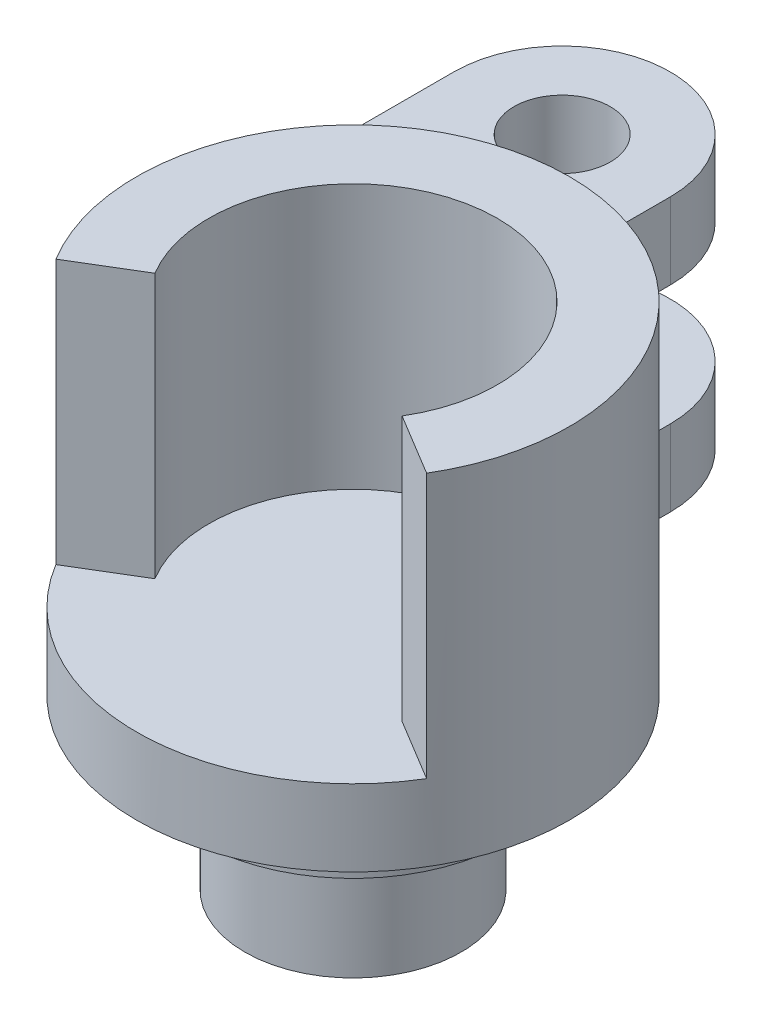
ISO-10303-21;
HEADER;
FILE_DESCRIPTION(('STEP AP214'),'2;1');
FILE_NAME('part.step','',(''),(''),'','','');
FILE_SCHEMA(('AUTOMOTIVE_DESIGN { 1 0 10303 214 1 1 1 1 }'));
ENDSEC;
DATA;
#1=APPLICATION_CONTEXT('core data for automotive mechanical design processes');
#2=APPLICATION_PROTOCOL_DEFINITION('international standard','automotive_design',2000,#1);
#3=PRODUCT_CONTEXT('',#1,'mechanical');
#4=PRODUCT('Part','Part','',(#3));
#5=PRODUCT_RELATED_PRODUCT_CATEGORY('part','',(#4));
#6=PRODUCT_DEFINITION_FORMATION('','',#4);
#7=PRODUCT_DEFINITION_CONTEXT('part definition',#1,'design');
#8=PRODUCT_DEFINITION('design','',#6,#7);
#9=PRODUCT_DEFINITION_SHAPE('','',#8);
#10=(LENGTH_UNIT() NAMED_UNIT(*) SI_UNIT(.MILLI.,.METRE.));
#11=(NAMED_UNIT(*) PLANE_ANGLE_UNIT() SI_UNIT($,.RADIAN.));
#12=(NAMED_UNIT(*) SI_UNIT($,.STERADIAN.) SOLID_ANGLE_UNIT());
#13=UNCERTAINTY_MEASURE_WITH_UNIT(LENGTH_MEASURE(1.E-05),#10,'distance_accuracy_value','');
#14=(GEOMETRIC_REPRESENTATION_CONTEXT(3) GLOBAL_UNCERTAINTY_ASSIGNED_CONTEXT((#13)) GLOBAL_UNIT_ASSIGNED_CONTEXT((#10,
#11,#12)) REPRESENTATION_CONTEXT('',''));
#15=CARTESIAN_POINT('',(0.,0.,0.));
#16=DIRECTION('',(0.,0.,1.));
#17=DIRECTION('',(1.,0.,0.));
#18=AXIS2_PLACEMENT_3D('',#15,#16,#17);
#19=CARTESIAN_POINT('',(0.,3.175,0.));
#20=DIRECTION('',(0.,-1.,0.));
#21=DIRECTION('',(0.,0.,-1.));
#22=AXIS2_PLACEMENT_3D('',#19,#20,#21);
#23=CYLINDRICAL_SURFACE('',#22,9.);
#24=DIRECTION('',(0.,-1.,0.));
#25=VECTOR('',#24,1.);
#26=CARTESIAN_POINT('',(0.,11.349999906,-9.));
#27=LINE('',#26,#25);
#28=CARTESIAN_POINT('',(0.,11.349999906,-9.));
#29=VERTEX_POINT('',#28);
#30=CARTESIAN_POINT('',(0.,8.174999906,-9.));
#31=VERTEX_POINT('',#30);
#32=EDGE_CURVE('E53',#29,#31,#27,.T.);
#33=ORIENTED_EDGE('',*,*,#32,.F.);
#34=CARTESIAN_POINT('',(0.,11.349999906,0.));
#35=DIRECTION('',(0.,-1.,0.));
#36=DIRECTION('',(0.,0.,1.));
#37=AXIS2_PLACEMENT_3D('',#34,#35,#36);
#38=CIRCLE('',#37,9.);
#39=CARTESIAN_POINT('',(-9.,11.349999906,0.));
#40=VERTEX_POINT('',#39);
#41=EDGE_CURVE('E58',#40,#29,#38,.T.);
#42=ORIENTED_EDGE('',*,*,#41,.F.);
#43=DIRECTION('',(0.,-1.,0.));
#44=VECTOR('',#43,1.);
#45=CARTESIAN_POINT('',(-9.,11.349999906,0.));
#46=LINE('',#45,#44);
#47=CARTESIAN_POINT('',(-9.,8.174999906,0.));
#48=VERTEX_POINT('',#47);
#49=EDGE_CURVE('E146',#40,#48,#46,.T.);
#50=ORIENTED_EDGE('',*,*,#49,.T.);
#51=CARTESIAN_POINT('',(0.,8.174999906,0.));
#52=DIRECTION('',(0.,-1.,0.));
#53=DIRECTION('',(0.,0.,1.));
#54=AXIS2_PLACEMENT_3D('',#51,#52,#53);
#55=CIRCLE('',#54,9.);
#56=EDGE_CURVE('E150',#48,#31,#55,.T.);
#57=ORIENTED_EDGE('',*,*,#56,.T.);
#58=EDGE_LOOP('',(#33,#42,#50,#57));
#59=FACE_BOUND('',#58,.T.);
#60=CARTESIAN_POINT('',(0.,3.175,0.));
#61=DIRECTION('',(0.,1.,0.));
#62=DIRECTION('',(0.,0.,1.));
#63=AXIS2_PLACEMENT_3D('',#60,#61,#62);
#64=CIRCLE('',#63,9.);
#65=CARTESIAN_POINT('',(-7.70770438364841,3.175,4.64664321142554));
#66=VERTEX_POINT('',#65);
#67=CARTESIAN_POINT('',(7.70770438364841,3.175,4.64664321142554));
#68=VERTEX_POINT('',#67);
#69=EDGE_CURVE('E202',#66,#68,#64,.T.);
#70=ORIENTED_EDGE('',*,*,#69,.F.);
#71=DIRECTION('',(0.,-1.,0.));
#72=VECTOR('',#71,1.);
#73=CARTESIAN_POINT('',(-7.70770438364841,14.175,4.64664321142554));
#74=LINE('',#73,#72);
#75=CARTESIAN_POINT('',(-7.70770438364841,14.175,4.64664321142554));
#76=VERTEX_POINT('',#75);
#77=EDGE_CURVE('E229',#76,#66,#74,.T.);
#78=ORIENTED_EDGE('',*,*,#77,.F.);
#79=CARTESIAN_POINT('',(0.,14.175,0.));
#80=DIRECTION('',(0.,1.,0.));
#81=DIRECTION('',(0.,0.,-1.));
#82=AXIS2_PLACEMENT_3D('',#79,#80,#81);
#83=CIRCLE('',#82,9.);
#84=CARTESIAN_POINT('',(7.70770438364841,14.175,4.64664321142554));
#85=VERTEX_POINT('',#84);
#86=EDGE_CURVE('E203',#85,#76,#83,.T.);
#87=ORIENTED_EDGE('',*,*,#86,.F.);
#88=DIRECTION('',(0.,-1.,0.));
#89=VECTOR('',#88,1.);
#90=CARTESIAN_POINT('',(7.70770438364841,14.175,4.64664321142554));
#91=LINE('',#90,#89);
#92=EDGE_CURVE('E213',#85,#68,#91,.T.);
#93=ORIENTED_EDGE('',*,*,#92,.T.);
#94=EDGE_LOOP('',(#70,#78,#87,#93));
#95=FACE_BOUND('',#94,.T.);
#96=DIRECTION('',(0.,-1.,0.));
#97=VECTOR('',#96,1.);
#98=CARTESIAN_POINT('',(0.,23.0265647372949,-9.));
#99=LINE('',#98,#97);
#100=CARTESIAN_POINT('',(0.,3.175,-9.));
#101=VERTEX_POINT('',#100);
#102=CARTESIAN_POINT('',(0.,0.,-9.));
#103=VERTEX_POINT('',#102);
#104=EDGE_CURVE('E175',#101,#103,#99,.T.);
#105=ORIENTED_EDGE('',*,*,#104,.F.);
#106=CARTESIAN_POINT('',(0.,3.175,0.));
#107=DIRECTION('',(0.,1.,0.));
#108=DIRECTION('',(0.,0.,1.));
#109=AXIS2_PLACEMENT_3D('',#106,#107,#108);
#110=CIRCLE('',#109,9.);
#111=CARTESIAN_POINT('',(-9.,3.175,0.));
#112=VERTEX_POINT('',#111);
#113=EDGE_CURVE('E183',#112,#101,#110,.F.);
#114=ORIENTED_EDGE('',*,*,#113,.F.);
#115=DIRECTION('',(0.,-1.,0.));
#116=VECTOR('',#115,1.);
#117=CARTESIAN_POINT('',(-9.,23.0265647372949,0.));
#118=LINE('',#117,#116);
#119=CARTESIAN_POINT('',(-9.,0.,0.));
#120=VERTEX_POINT('',#119);
#121=EDGE_CURVE('E162',#112,#120,#118,.T.);
#122=ORIENTED_EDGE('',*,*,#121,.T.);
#123=CARTESIAN_POINT('',(0.,0.,0.));
#124=DIRECTION('',(0.,1.,0.));
#125=DIRECTION('',(0.,0.,1.));
#126=AXIS2_PLACEMENT_3D('',#123,#124,#125);
#127=CIRCLE('',#126,9.);
#128=EDGE_CURVE('E232',#120,#103,#127,.T.);
#129=ORIENTED_EDGE('',*,*,#128,.T.);
#130=EDGE_LOOP('',(#105,#114,#122,#129));
#131=FACE_BOUND('',#130,.T.);
#132=ADVANCED_FACE('F37',(#59,#95,#131),#23,.T.);
#133=CARTESIAN_POINT('',(0.,3.175,0.));
#134=DIRECTION('',(0.,1.,0.));
#135=DIRECTION('',(0.,0.,1.));
#136=AXIS2_PLACEMENT_3D('',#133,#134,#135);
#137=PLANE('',#136);
#138=DIRECTION('',(0.856411598183157,0.,0.516293690158394));
#139=VECTOR('',#138,1.);
#140=CARTESIAN_POINT('',(5.13846958909894,3.175,3.09776214095036));
#141=LINE('',#140,#139);
#142=CARTESIAN_POINT('',(5.13846958909894,3.175,3.09776214095036));
#143=VERTEX_POINT('',#142);
#144=EDGE_CURVE('E207',#143,#68,#141,.T.);
#145=ORIENTED_EDGE('',*,*,#144,.F.);
#146=CARTESIAN_POINT('',(0.,3.175,0.));
#147=DIRECTION('',(0.,-1.,0.));
#148=DIRECTION('',(0.,0.,-1.));
#149=AXIS2_PLACEMENT_3D('',#146,#147,#148);
#150=CIRCLE('',#149,6.);
#151=CARTESIAN_POINT('',(-5.13846958909894,3.175,3.09776214095036));
#152=VERTEX_POINT('',#151);
#153=EDGE_CURVE('E216',#152,#143,#150,.T.);
#154=ORIENTED_EDGE('',*,*,#153,.F.);
#155=DIRECTION('',(0.856411598183157,0.,-0.516293690158393));
#156=VECTOR('',#155,1.);
#157=CARTESIAN_POINT('',(-7.70770438364841,3.175,4.64664321142554));
#158=LINE('',#157,#156);
#159=EDGE_CURVE('E199',#66,#152,#158,.T.);
#160=ORIENTED_EDGE('',*,*,#159,.F.);
#161=ORIENTED_EDGE('',*,*,#69,.T.);
#162=EDGE_LOOP('',(#145,#154,#160,#161));
#163=FACE_BOUND('',#162,.T.);
#164=ADVANCED_FACE('F263',(#163),#137,.T.);
#165=CARTESIAN_POINT('',(0.,0.,0.));
#166=DIRECTION('',(0.,1.,0.));
#167=DIRECTION('',(0.,0.,1.));
#168=AXIS2_PLACEMENT_3D('',#165,#166,#167);
#169=PLANE('',#168);
#170=CARTESIAN_POINT('',(-4.5,0.,-13.1941974251168));
#171=DIRECTION('',(0.,1.,0.));
#172=DIRECTION('',(0.,0.,1.));
#173=AXIS2_PLACEMENT_3D('',#170,#171,#172);
#174=CIRCLE('',#173,2.);
#175=CARTESIAN_POINT('',(-4.5,0.,-11.1941974251168));
#176=VERTEX_POINT('',#175);
#177=EDGE_CURVE('E304',#176,#176,#174,.F.);
#178=ORIENTED_EDGE('',*,*,#177,.F.);
#179=EDGE_LOOP('',(#178));
#180=FACE_BOUND('',#179,.T.);
#181=CARTESIAN_POINT('',(0.,0.,0.));
#182=DIRECTION('',(0.,-1.,0.));
#183=DIRECTION('',(0.,0.,-1.));
#184=AXIS2_PLACEMENT_3D('',#181,#182,#183);
#185=CIRCLE('',#184,6.5);
#186=CARTESIAN_POINT('',(0.,0.,-6.5));
#187=VERTEX_POINT('',#186);
#188=EDGE_CURVE('E45',#187,#187,#185,.T.);
#189=ORIENTED_EDGE('',*,*,#188,.F.);
#190=EDGE_LOOP('',(#189));
#191=FACE_BOUND('',#190,.T.);
#192=ORIENTED_EDGE('',*,*,#128,.F.);
#193=DIRECTION('',(0.,0.,1.));
#194=VECTOR('',#193,1.);
#195=CARTESIAN_POINT('',(-9.,0.,0.));
#196=LINE('',#195,#194);
#197=CARTESIAN_POINT('',(-9.,0.,-13.1941974251168));
#198=VERTEX_POINT('',#197);
#199=EDGE_CURVE('E163',#198,#120,#196,.T.);
#200=ORIENTED_EDGE('',*,*,#199,.F.);
#201=CARTESIAN_POINT('',(-4.5,0.,-13.1941974251168));
#202=DIRECTION('',(0.,1.,0.));
#203=DIRECTION('',(0.,0.,1.));
#204=AXIS2_PLACEMENT_3D('',#201,#202,#203);
#205=CIRCLE('',#204,4.5);
#206=CARTESIAN_POINT('',(0.,0.,-13.1941974251168));
#207=VERTEX_POINT('',#206);
#208=EDGE_CURVE('E168',#207,#198,#205,.T.);
#209=ORIENTED_EDGE('',*,*,#208,.F.);
#210=DIRECTION('',(0.,0.,-1.));
#211=VECTOR('',#210,1.);
#212=CARTESIAN_POINT('',(0.,0.,-9.));
#213=LINE('',#212,#211);
#214=EDGE_CURVE('E172',#103,#207,#213,.T.);
#215=ORIENTED_EDGE('',*,*,#214,.F.);
#216=EDGE_LOOP('',(#192,#200,#209,#215));
#217=FACE_BOUND('',#216,.T.);
#218=ADVANCED_FACE('F243',(#180,#191,#217),#169,.F.);
#219=CARTESIAN_POINT('',(-7.70770438364841,14.175,4.64664321142554));
#220=DIRECTION('',(-0.516293690158393,0.,-0.856411598183157));
#221=DIRECTION('',(-0.856411598183157,0.,0.516293690158393));
#222=AXIS2_PLACEMENT_3D('',#219,#220,#221);
#223=PLANE('',#222);
#224=ORIENTED_EDGE('',*,*,#159,.T.);
#225=DIRECTION('',(0.,-1.,0.));
#226=VECTOR('',#225,1.);
#227=CARTESIAN_POINT('',(-5.13846958909894,14.175,3.09776214095036));
#228=LINE('',#227,#226);
#229=CARTESIAN_POINT('',(-5.13846958909894,14.175,3.09776214095036));
#230=VERTEX_POINT('',#229);
#231=EDGE_CURVE('E226',#230,#152,#228,.T.);
#232=ORIENTED_EDGE('',*,*,#231,.F.);
#233=DIRECTION('',(0.856411598183157,0.,-0.516293690158393));
#234=VECTOR('',#233,1.);
#235=CARTESIAN_POINT('',(-7.70770438364841,14.175,4.64664321142554));
#236=LINE('',#235,#234);
#237=EDGE_CURVE('E206',#76,#230,#236,.T.);
#238=ORIENTED_EDGE('',*,*,#237,.F.);
#239=ORIENTED_EDGE('',*,*,#77,.T.);
#240=EDGE_LOOP('',(#224,#232,#238,#239));
#241=FACE_BOUND('',#240,.T.);
#242=ADVANCED_FACE('F276',(#241),#223,.F.);
#243=CARTESIAN_POINT('',(0.,14.175,0.));
#244=DIRECTION('',(0.,-1.,0.));
#245=DIRECTION('',(0.,0.,-1.));
#246=AXIS2_PLACEMENT_3D('',#243,#244,#245);
#247=CYLINDRICAL_SURFACE('',#246,6.);
#248=ORIENTED_EDGE('',*,*,#153,.T.);
#249=DIRECTION('',(0.,-1.,0.));
#250=VECTOR('',#249,1.);
#251=CARTESIAN_POINT('',(5.13846958909894,14.175,3.09776214095036));
#252=LINE('',#251,#250);
#253=CARTESIAN_POINT('',(5.13846958909894,14.175,3.09776214095036));
#254=VERTEX_POINT('',#253);
#255=EDGE_CURVE('E223',#254,#143,#252,.T.);
#256=ORIENTED_EDGE('',*,*,#255,.F.);
#257=CARTESIAN_POINT('',(0.,14.175,0.));
#258=DIRECTION('',(0.,-1.,0.));
#259=DIRECTION('',(0.,0.,-1.));
#260=AXIS2_PLACEMENT_3D('',#257,#258,#259);
#261=CIRCLE('',#260,6.);
#262=EDGE_CURVE('E209',#230,#254,#261,.T.);
#263=ORIENTED_EDGE('',*,*,#262,.F.);
#264=ORIENTED_EDGE('',*,*,#231,.T.);
#265=EDGE_LOOP('',(#248,#256,#263,#264));
#266=FACE_BOUND('',#265,.T.);
#267=ADVANCED_FACE('F286',(#266),#247,.F.);
#268=CARTESIAN_POINT('',(5.13846958909894,14.175,3.09776214095036));
#269=DIRECTION('',(0.516293690158394,0.,-0.856411598183157));
#270=DIRECTION('',(-0.856411598183157,0.,-0.516293690158394));
#271=AXIS2_PLACEMENT_3D('',#268,#269,#270);
#272=PLANE('',#271);
#273=ORIENTED_EDGE('',*,*,#144,.T.);
#274=ORIENTED_EDGE('',*,*,#92,.F.);
#275=DIRECTION('',(0.856411598183157,0.,0.516293690158394));
#276=VECTOR('',#275,1.);
#277=CARTESIAN_POINT('',(5.13846958909894,14.175,3.09776214095036));
#278=LINE('',#277,#276);
#279=EDGE_CURVE('E211',#254,#85,#278,.T.);
#280=ORIENTED_EDGE('',*,*,#279,.F.);
#281=ORIENTED_EDGE('',*,*,#255,.T.);
#282=EDGE_LOOP('',(#273,#274,#280,#281));
#283=FACE_BOUND('',#282,.T.);
#284=ADVANCED_FACE('F284',(#283),#272,.F.);
#285=CARTESIAN_POINT('',(0.,14.175,0.));
#286=DIRECTION('',(0.,-1.,0.));
#287=DIRECTION('',(0.,0.,-1.));
#288=AXIS2_PLACEMENT_3D('',#285,#286,#287);
#289=PLANE('',#288);
#290=ORIENTED_EDGE('',*,*,#86,.T.);
#291=ORIENTED_EDGE('',*,*,#237,.T.);
#292=ORIENTED_EDGE('',*,*,#262,.T.);
#293=ORIENTED_EDGE('',*,*,#279,.T.);
#294=EDGE_LOOP('',(#290,#291,#292,#293));
#295=FACE_BOUND('',#294,.T.);
#296=ADVANCED_FACE('F280',(#295),#289,.F.);
#297=CARTESIAN_POINT('',(0.,-2.,0.));
#298=DIRECTION('',(0.,1.,0.));
#299=DIRECTION('',(0.,0.,1.));
#300=AXIS2_PLACEMENT_3D('',#297,#298,#299);
#301=CYLINDRICAL_SURFACE('',#300,6.5);
#302=CARTESIAN_POINT('',(0.,-2.,0.));
#303=DIRECTION('',(0.,-1.,0.));
#304=DIRECTION('',(0.,0.,-1.));
#305=AXIS2_PLACEMENT_3D('',#302,#303,#304);
#306=CIRCLE('',#305,6.5);
#307=CARTESIAN_POINT('',(0.,-2.,-6.5));
#308=VERTEX_POINT('',#307);
#309=EDGE_CURVE('E195',#308,#308,#306,.T.);
#310=ORIENTED_EDGE('',*,*,#309,.F.);
#311=EDGE_LOOP('',(#310));
#312=FACE_BOUND('',#311,.T.);
#313=ORIENTED_EDGE('',*,*,#188,.T.);
#314=EDGE_LOOP('',(#313));
#315=FACE_BOUND('',#314,.T.);
#316=ADVANCED_FACE('F307',(#312,#315),#301,.T.);
#317=CARTESIAN_POINT('',(0.,-2.,0.));
#318=DIRECTION('',(0.,-1.,0.));
#319=DIRECTION('',(0.,0.,-1.));
#320=AXIS2_PLACEMENT_3D('',#317,#318,#319);
#321=PLANE('',#320);
#322=CARTESIAN_POINT('',(0.,-2.,0.));
#323=DIRECTION('',(0.,-1.,0.));
#324=DIRECTION('',(0.,0.,-1.));
#325=AXIS2_PLACEMENT_3D('',#322,#323,#324);
#326=CIRCLE('',#325,4.5);
#327=CARTESIAN_POINT('',(0.,-2.,-4.5));
#328=VERTEX_POINT('',#327);
#329=EDGE_CURVE('E11',#328,#328,#326,.T.);
#330=ORIENTED_EDGE('',*,*,#329,.F.);
#331=EDGE_LOOP('',(#330));
#332=FACE_BOUND('',#331,.T.);
#333=ORIENTED_EDGE('',*,*,#309,.T.);
#334=EDGE_LOOP('',(#333));
#335=FACE_BOUND('',#334,.T.);
#336=ADVANCED_FACE('F309',(#332,#335),#321,.T.);
#337=CARTESIAN_POINT('',(0.,-7.,0.));
#338=DIRECTION('',(0.,1.,0.));
#339=DIRECTION('',(0.,0.,1.));
#340=AXIS2_PLACEMENT_3D('',#337,#338,#339);
#341=CYLINDRICAL_SURFACE('',#340,4.5);
#342=CARTESIAN_POINT('',(0.,-7.,0.));
#343=DIRECTION('',(0.,-1.,0.));
#344=DIRECTION('',(0.,0.,-1.));
#345=AXIS2_PLACEMENT_3D('',#342,#343,#344);
#346=CIRCLE('',#345,4.5);
#347=CARTESIAN_POINT('',(0.,-7.,-4.5));
#348=VERTEX_POINT('',#347);
#349=EDGE_CURVE('E179',#348,#348,#346,.T.);
#350=ORIENTED_EDGE('',*,*,#349,.F.);
#351=EDGE_LOOP('',(#350));
#352=FACE_BOUND('',#351,.T.);
#353=ORIENTED_EDGE('',*,*,#329,.T.);
#354=EDGE_LOOP('',(#353));
#355=FACE_BOUND('',#354,.T.);
#356=ADVANCED_FACE('F316',(#352,#355),#341,.T.);
#357=CARTESIAN_POINT('',(0.,-7.,0.));
#358=DIRECTION('',(0.,-1.,0.));
#359=DIRECTION('',(0.,0.,-1.));
#360=AXIS2_PLACEMENT_3D('',#357,#358,#359);
#361=PLANE('',#360);
#362=ORIENTED_EDGE('',*,*,#349,.T.);
#363=EDGE_LOOP('',(#362));
#364=FACE_BOUND('',#363,.T.);
#365=ADVANCED_FACE('F323',(#364),#361,.T.);
#366=CARTESIAN_POINT('',(0.,23.0265647372949,-9.));
#367=DIRECTION('',(-1.,0.,0.));
#368=DIRECTION('',(0.,0.,1.));
#369=AXIS2_PLACEMENT_3D('',#366,#367,#368);
#370=PLANE('',#369);
#371=DIRECTION('',(0.,0.,-1.));
#372=VECTOR('',#371,1.);
#373=CARTESIAN_POINT('',(0.,3.175,-9.));
#374=LINE('',#373,#372);
#375=CARTESIAN_POINT('',(0.,3.175,-13.1941974251168));
#376=VERTEX_POINT('',#375);
#377=EDGE_CURVE('E180',#101,#376,#374,.T.);
#378=ORIENTED_EDGE('',*,*,#377,.F.);
#379=ORIENTED_EDGE('',*,*,#104,.T.);
#380=ORIENTED_EDGE('',*,*,#214,.T.);
#381=DIRECTION('',(0.,-1.,0.));
#382=VECTOR('',#381,1.);
#383=CARTESIAN_POINT('',(0.,23.0265647372949,-13.1941974251168));
#384=LINE('',#383,#382);
#385=EDGE_CURVE('E171',#376,#207,#384,.T.);
#386=ORIENTED_EDGE('',*,*,#385,.F.);
#387=EDGE_LOOP('',(#378,#379,#380,#386));
#388=FACE_BOUND('',#387,.T.);
#389=ADVANCED_FACE('F240',(#388),#370,.F.);
#390=CARTESIAN_POINT('',(-4.5,23.0265647372949,-13.1941974251168));
#391=DIRECTION('',(0.,-1.,0.));
#392=DIRECTION('',(0.,0.,-1.));
#393=AXIS2_PLACEMENT_3D('',#390,#391,#392);
#394=CYLINDRICAL_SURFACE('',#393,4.5);
#395=CARTESIAN_POINT('',(-4.5,3.175,-13.1941974251168));
#396=DIRECTION('',(0.,1.,0.));
#397=DIRECTION('',(0.,0.,1.));
#398=AXIS2_PLACEMENT_3D('',#395,#396,#397);
#399=CIRCLE('',#398,4.5);
#400=CARTESIAN_POINT('',(-9.,3.175,-13.1941974251168));
#401=VERTEX_POINT('',#400);
#402=EDGE_CURVE('E176',#376,#401,#399,.T.);
#403=ORIENTED_EDGE('',*,*,#402,.F.);
#404=ORIENTED_EDGE('',*,*,#385,.T.);
#405=ORIENTED_EDGE('',*,*,#208,.T.);
#406=DIRECTION('',(0.,-1.,0.));
#407=VECTOR('',#406,1.);
#408=CARTESIAN_POINT('',(-9.,23.0265647372949,-13.1941974251168));
#409=LINE('',#408,#407);
#410=EDGE_CURVE('E167',#401,#198,#409,.T.);
#411=ORIENTED_EDGE('',*,*,#410,.F.);
#412=EDGE_LOOP('',(#403,#404,#405,#411));
#413=FACE_BOUND('',#412,.T.);
#414=ADVANCED_FACE('F245',(#413),#394,.T.);
#415=CARTESIAN_POINT('',(-9.,23.0265647372949,0.));
#416=DIRECTION('',(1.,0.,0.));
#417=DIRECTION('',(0.,0.,-1.));
#418=AXIS2_PLACEMENT_3D('',#415,#416,#417);
#419=PLANE('',#418);
#420=DIRECTION('',(0.,0.,1.));
#421=VECTOR('',#420,1.);
#422=CARTESIAN_POINT('',(-9.,3.175,0.));
#423=LINE('',#422,#421);
#424=EDGE_CURVE('E166',#401,#112,#423,.T.);
#425=ORIENTED_EDGE('',*,*,#424,.F.);
#426=ORIENTED_EDGE('',*,*,#410,.T.);
#427=ORIENTED_EDGE('',*,*,#199,.T.);
#428=ORIENTED_EDGE('',*,*,#121,.F.);
#429=EDGE_LOOP('',(#425,#426,#427,#428));
#430=FACE_BOUND('',#429,.T.);
#431=ADVANCED_FACE('F250',(#430),#419,.F.);
#432=CARTESIAN_POINT('',(0.,3.175,0.));
#433=DIRECTION('',(0.,1.,0.));
#434=DIRECTION('',(0.,0.,1.));
#435=AXIS2_PLACEMENT_3D('',#432,#433,#434);
#436=PLANE('',#435);
#437=CARTESIAN_POINT('',(-4.5,3.175,-13.1941974251168));
#438=DIRECTION('',(0.,1.,0.));
#439=DIRECTION('',(0.,0.,1.));
#440=AXIS2_PLACEMENT_3D('',#437,#438,#439);
#441=CIRCLE('',#440,2.);
#442=CARTESIAN_POINT('',(-4.5,3.175,-11.1941974251168));
#443=VERTEX_POINT('',#442);
#444=EDGE_CURVE('E152',#443,#443,#441,.T.);
#445=ORIENTED_EDGE('',*,*,#444,.F.);
#446=EDGE_LOOP('',(#445));
#447=FACE_BOUND('',#446,.T.);
#448=ORIENTED_EDGE('',*,*,#424,.T.);
#449=ORIENTED_EDGE('',*,*,#113,.T.);
#450=ORIENTED_EDGE('',*,*,#377,.T.);
#451=ORIENTED_EDGE('',*,*,#402,.T.);
#452=EDGE_LOOP('',(#448,#449,#450,#451));
#453=FACE_BOUND('',#452,.T.);
#454=ADVANCED_FACE('F248',(#447,#453),#436,.T.);
#455=CARTESIAN_POINT('',(0.,11.349999906,-9.));
#456=DIRECTION('',(-1.,0.,0.));
#457=DIRECTION('',(0.,0.,1.));
#458=AXIS2_PLACEMENT_3D('',#455,#456,#457);
#459=PLANE('',#458);
#460=DIRECTION('',(0.,0.,-1.));
#461=VECTOR('',#460,1.);
#462=CARTESIAN_POINT('',(0.,8.174999906,-9.));
#463=LINE('',#462,#461);
#464=CARTESIAN_POINT('',(0.,8.174999906,-13.1941974251168));
#465=VERTEX_POINT('',#464);
#466=EDGE_CURVE('E136',#31,#465,#463,.T.);
#467=ORIENTED_EDGE('',*,*,#466,.T.);
#468=DIRECTION('',(0.,-1.,0.));
#469=VECTOR('',#468,1.);
#470=CARTESIAN_POINT('',(0.,11.349999906,-13.1941974251168));
#471=LINE('',#470,#469);
#472=CARTESIAN_POINT('',(0.,11.349999906,-13.1941974251168));
#473=VERTEX_POINT('',#472);
#474=EDGE_CURVE('E133',#473,#465,#471,.T.);
#475=ORIENTED_EDGE('',*,*,#474,.F.);
#476=DIRECTION('',(0.,0.,-1.));
#477=VECTOR('',#476,1.);
#478=CARTESIAN_POINT('',(0.,11.349999906,-9.));
#479=LINE('',#478,#477);
#480=EDGE_CURVE('E124',#29,#473,#479,.T.);
#481=ORIENTED_EDGE('',*,*,#480,.F.);
#482=ORIENTED_EDGE('',*,*,#32,.T.);
#483=EDGE_LOOP('',(#467,#475,#481,#482));
#484=FACE_BOUND('',#483,.T.);
#485=ADVANCED_FACE('F134',(#484),#459,.F.);
#486=CARTESIAN_POINT('',(-4.5,11.349999906,-13.1941974251168));
#487=DIRECTION('',(0.,-1.,0.));
#488=DIRECTION('',(0.,0.,-1.));
#489=AXIS2_PLACEMENT_3D('',#486,#487,#488);
#490=CYLINDRICAL_SURFACE('',#489,4.5);
#491=CARTESIAN_POINT('',(-4.5,8.174999906,-13.1941974251168));
#492=DIRECTION('',(0.,1.,0.));
#493=DIRECTION('',(0.,0.,1.));
#494=AXIS2_PLACEMENT_3D('',#491,#492,#493);
#495=CIRCLE('',#494,4.5);
#496=CARTESIAN_POINT('',(-9.,8.174999906,-13.1941974251168));
#497=VERTEX_POINT('',#496);
#498=EDGE_CURVE('E154',#465,#497,#495,.T.);
#499=ORIENTED_EDGE('',*,*,#498,.T.);
#500=DIRECTION('',(0.,-1.,0.));
#501=VECTOR('',#500,1.);
#502=CARTESIAN_POINT('',(-9.,11.349999906,-13.1941974251168));
#503=LINE('',#502,#501);
#504=CARTESIAN_POINT('',(-9.,11.349999906,-13.1941974251168));
#505=VERTEX_POINT('',#504);
#506=EDGE_CURVE('E139',#505,#497,#503,.T.);
#507=ORIENTED_EDGE('',*,*,#506,.F.);
#508=CARTESIAN_POINT('',(-4.5,11.349999906,-13.1941974251168));
#509=DIRECTION('',(0.,1.,0.));
#510=DIRECTION('',(0.,0.,1.));
#511=AXIS2_PLACEMENT_3D('',#508,#509,#510);
#512=CIRCLE('',#511,4.5);
#513=EDGE_CURVE('E128',#473,#505,#512,.T.);
#514=ORIENTED_EDGE('',*,*,#513,.F.);
#515=ORIENTED_EDGE('',*,*,#474,.T.);
#516=EDGE_LOOP('',(#499,#507,#514,#515));
#517=FACE_BOUND('',#516,.T.);
#518=ADVANCED_FACE('F141',(#517),#490,.T.);
#519=CARTESIAN_POINT('',(-9.,11.349999906,-13.1941974251168));
#520=DIRECTION('',(1.,0.,0.));
#521=DIRECTION('',(0.,0.,-1.));
#522=AXIS2_PLACEMENT_3D('',#519,#520,#521);
#523=PLANE('',#522);
#524=DIRECTION('',(0.,0.,1.));
#525=VECTOR('',#524,1.);
#526=CARTESIAN_POINT('',(-9.,8.174999906,-13.1941974251168));
#527=LINE('',#526,#525);
#528=EDGE_CURVE('E156',#497,#48,#527,.T.);
#529=ORIENTED_EDGE('',*,*,#528,.T.);
#530=ORIENTED_EDGE('',*,*,#49,.F.);
#531=DIRECTION('',(0.,0.,1.));
#532=VECTOR('',#531,1.);
#533=CARTESIAN_POINT('',(-9.,11.349999906,-13.1941974251168));
#534=LINE('',#533,#532);
#535=EDGE_CURVE('E144',#505,#40,#534,.T.);
#536=ORIENTED_EDGE('',*,*,#535,.F.);
#537=ORIENTED_EDGE('',*,*,#506,.T.);
#538=EDGE_LOOP('',(#529,#530,#536,#537));
#539=FACE_BOUND('',#538,.T.);
#540=ADVANCED_FACE('F370',(#539),#523,.F.);
#541=CARTESIAN_POINT('',(0.,11.349999906,0.));
#542=DIRECTION('',(0.,1.,0.));
#543=DIRECTION('',(0.,0.,1.));
#544=AXIS2_PLACEMENT_3D('',#541,#542,#543);
#545=PLANE('',#544);
#546=CARTESIAN_POINT('',(-4.5,11.349999906,-13.1941974251168));
#547=DIRECTION('',(0.,1.,0.));
#548=DIRECTION('',(0.,0.,1.));
#549=AXIS2_PLACEMENT_3D('',#546,#547,#548);
#550=CIRCLE('',#549,2.);
#551=CARTESIAN_POINT('',(-4.5,11.349999906,-11.1941974251168));
#552=VERTEX_POINT('',#551);
#553=EDGE_CURVE('E429',#552,#552,#550,.T.);
#554=ORIENTED_EDGE('',*,*,#553,.F.);
#555=EDGE_LOOP('',(#554));
#556=FACE_BOUND('',#555,.T.);
#557=ORIENTED_EDGE('',*,*,#41,.T.);
#558=ORIENTED_EDGE('',*,*,#480,.T.);
#559=ORIENTED_EDGE('',*,*,#513,.T.);
#560=ORIENTED_EDGE('',*,*,#535,.T.);
#561=EDGE_LOOP('',(#557,#558,#559,#560));
#562=FACE_BOUND('',#561,.T.);
#563=ADVANCED_FACE('F126',(#556,#562),#545,.T.);
#564=CARTESIAN_POINT('',(0.,8.174999906,0.));
#565=DIRECTION('',(0.,1.,0.));
#566=DIRECTION('',(0.,0.,1.));
#567=AXIS2_PLACEMENT_3D('',#564,#565,#566);
#568=PLANE('',#567);
#569=CARTESIAN_POINT('',(-4.5,8.174999906,-13.1941974251168));
#570=DIRECTION('',(0.,1.,0.));
#571=DIRECTION('',(0.,0.,1.));
#572=AXIS2_PLACEMENT_3D('',#569,#570,#571);
#573=CIRCLE('',#572,2.);
#574=CARTESIAN_POINT('',(-4.5,8.174999906,-11.1941974251168));
#575=VERTEX_POINT('',#574);
#576=EDGE_CURVE('E40',#575,#575,#573,.T.);
#577=ORIENTED_EDGE('',*,*,#576,.T.);
#578=EDGE_LOOP('',(#577));
#579=FACE_BOUND('',#578,.T.);
#580=ORIENTED_EDGE('',*,*,#56,.F.);
#581=ORIENTED_EDGE('',*,*,#528,.F.);
#582=ORIENTED_EDGE('',*,*,#498,.F.);
#583=ORIENTED_EDGE('',*,*,#466,.F.);
#584=EDGE_LOOP('',(#580,#581,#582,#583));
#585=FACE_BOUND('',#584,.T.);
#586=ADVANCED_FACE('F389',(#579,#585),#568,.F.);
#587=CARTESIAN_POINT('',(-4.5,-5.65685424949238,-13.1941974251168));
#588=DIRECTION('',(0.,1.,0.));
#589=DIRECTION('',(0.,0.,1.));
#590=AXIS2_PLACEMENT_3D('',#587,#588,#589);
#591=CYLINDRICAL_SURFACE('',#590,2.);
#592=ORIENTED_EDGE('',*,*,#553,.T.);
#593=EDGE_LOOP('',(#592));
#594=FACE_BOUND('',#593,.T.);
#595=ORIENTED_EDGE('',*,*,#576,.F.);
#596=EDGE_LOOP('',(#595));
#597=FACE_BOUND('',#596,.T.);
#598=ADVANCED_FACE('F400',(#594,#597),#591,.F.);
#599=ORIENTED_EDGE('',*,*,#444,.T.);
#600=EDGE_LOOP('',(#599));
#601=FACE_BOUND('',#600,.T.);
#602=ORIENTED_EDGE('',*,*,#177,.T.);
#603=EDGE_LOOP('',(#602));
#604=FACE_BOUND('',#603,.T.);
#605=ADVANCED_FACE('F411',(#601,#604),#591,.F.);
#606=CLOSED_SHELL('',(#132,#164,#218,#242,#267,#284,#296,#316,#336,#356,#365,#389,#414,#431,
#454,#485,#518,#540,#563,#586,#598,#605));
#607=MANIFOLD_SOLID_BREP('B2',#606);
#608=ADVANCED_BREP_SHAPE_REPRESENTATION('',(#18,#607),#14);
#609=SHAPE_DEFINITION_REPRESENTATION(#9,#608);
ENDSEC;
END-ISO-10303-21;
